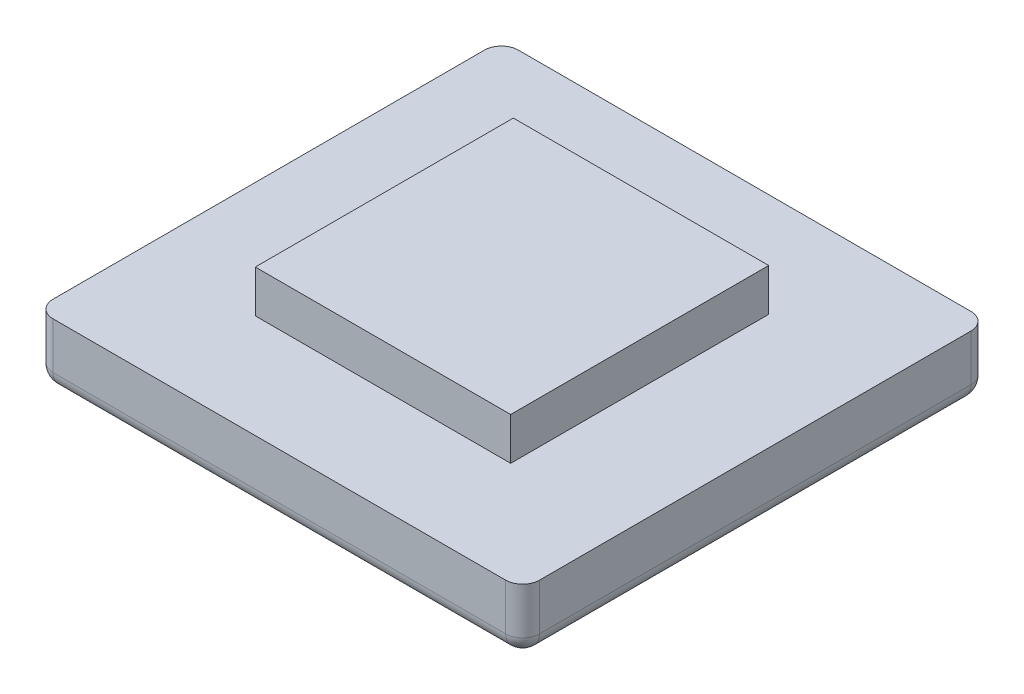
ISO-10303-21;
HEADER;
FILE_DESCRIPTION(('STEP AP214'),'2;1');
FILE_NAME('part.step','',(''),(''),'','','');
FILE_SCHEMA(('AUTOMOTIVE_DESIGN { 1 0 10303 214 1 1 1 1 }'));
ENDSEC;
DATA;
#1=APPLICATION_CONTEXT('core data for automotive mechanical design processes');
#2=APPLICATION_PROTOCOL_DEFINITION('international standard','automotive_design',2000,#1);
#3=PRODUCT_CONTEXT('',#1,'mechanical');
#4=PRODUCT('Part','Part','',(#3));
#5=PRODUCT_RELATED_PRODUCT_CATEGORY('part','',(#4));
#6=PRODUCT_DEFINITION_FORMATION('','',#4);
#7=PRODUCT_DEFINITION_CONTEXT('part definition',#1,'design');
#8=PRODUCT_DEFINITION('design','',#6,#7);
#9=PRODUCT_DEFINITION_SHAPE('','',#8);
#10=(LENGTH_UNIT() NAMED_UNIT(*) SI_UNIT(.MILLI.,.METRE.));
#11=(NAMED_UNIT(*) PLANE_ANGLE_UNIT() SI_UNIT($,.RADIAN.));
#12=(NAMED_UNIT(*) SI_UNIT($,.STERADIAN.) SOLID_ANGLE_UNIT());
#13=UNCERTAINTY_MEASURE_WITH_UNIT(LENGTH_MEASURE(1.E-05),#10,'distance_accuracy_value','');
#14=(GEOMETRIC_REPRESENTATION_CONTEXT(3) GLOBAL_UNCERTAINTY_ASSIGNED_CONTEXT((#13)) GLOBAL_UNIT_ASSIGNED_CONTEXT((#10,
#11,#12)) REPRESENTATION_CONTEXT('',''));
#15=CARTESIAN_POINT('',(0.,0.,0.));
#16=DIRECTION('',(0.,0.,1.));
#17=DIRECTION('',(1.,0.,0.));
#18=AXIS2_PLACEMENT_3D('',#15,#16,#17);
#19=CARTESIAN_POINT('',(0.,15.,0.));
#20=DIRECTION('',(0.,-1.,0.));
#21=DIRECTION('',(0.,0.,-1.));
#22=AXIS2_PLACEMENT_3D('',#19,#20,#21);
#23=PLANE('',#22);
#24=DIRECTION('',(0.,0.,-1.));
#25=VECTOR('',#24,1.);
#26=CARTESIAN_POINT('',(93.8648648648648,15.,53.8986486486486));
#27=LINE('',#26,#25);
#28=CARTESIAN_POINT('',(93.8648648648648,15.,49.8986486486486));
#29=VERTEX_POINT('',#28);
#30=CARTESIAN_POINT('',(93.8648648648649,15.,-52.1013513513514));
#31=VERTEX_POINT('',#30);
#32=EDGE_CURVE('E189',#29,#31,#27,.T.);
#33=ORIENTED_EDGE('',*,*,#32,.T.);
#34=CARTESIAN_POINT('',(89.8648648648649,15.,-52.1013513513514));
#35=DIRECTION('',(0.,-1.,0.));
#36=DIRECTION('',(0.,0.,-1.));
#37=AXIS2_PLACEMENT_3D('',#34,#35,#36);
#38=CIRCLE('',#37,4.);
#39=CARTESIAN_POINT('',(89.8648648648649,15.,-56.1013513513514));
#40=VERTEX_POINT('',#39);
#41=EDGE_CURVE('E11',#31,#40,#38,.F.);
#42=ORIENTED_EDGE('',*,*,#41,.T.);
#43=DIRECTION('',(-1.,0.,0.));
#44=VECTOR('',#43,1.);
#45=CARTESIAN_POINT('',(-21.1351351351351,15.,-56.1013513513514));
#46=LINE('',#45,#44);
#47=CARTESIAN_POINT('',(-17.1351351351351,15.,-56.1013513513514));
#48=VERTEX_POINT('',#47);
#49=EDGE_CURVE('E193',#40,#48,#46,.T.);
#50=ORIENTED_EDGE('',*,*,#49,.T.);
#51=CARTESIAN_POINT('',(-17.1351351351351,15.,-52.1013513513514));
#52=DIRECTION('',(0.,-1.,0.));
#53=DIRECTION('',(0.,0.,-1.));
#54=AXIS2_PLACEMENT_3D('',#51,#52,#53);
#55=CIRCLE('',#54,4.);
#56=CARTESIAN_POINT('',(-21.1351351351351,15.,-52.1013513513514));
#57=VERTEX_POINT('',#56);
#58=EDGE_CURVE('E245',#48,#57,#55,.F.);
#59=ORIENTED_EDGE('',*,*,#58,.T.);
#60=DIRECTION('',(0.,0.,1.));
#61=VECTOR('',#60,1.);
#62=CARTESIAN_POINT('',(-21.1351351351351,15.,53.8986486486486));
#63=LINE('',#62,#61);
#64=CARTESIAN_POINT('',(-21.1351351351351,15.,49.8986486486486));
#65=VERTEX_POINT('',#64);
#66=EDGE_CURVE('E175',#57,#65,#63,.T.);
#67=ORIENTED_EDGE('',*,*,#66,.T.);
#68=CARTESIAN_POINT('',(-17.1351351351351,15.,49.8986486486486));
#69=DIRECTION('',(0.,-1.,0.));
#70=DIRECTION('',(0.,0.,-1.));
#71=AXIS2_PLACEMENT_3D('',#68,#69,#70);
#72=CIRCLE('',#71,4.);
#73=CARTESIAN_POINT('',(-17.1351351351351,15.,53.8986486486486));
#74=VERTEX_POINT('',#73);
#75=EDGE_CURVE('E248',#65,#74,#72,.F.);
#76=ORIENTED_EDGE('',*,*,#75,.T.);
#77=DIRECTION('',(1.,0.,0.));
#78=VECTOR('',#77,1.);
#79=CARTESIAN_POINT('',(-21.1351351351351,15.,53.8986486486486));
#80=LINE('',#79,#78);
#81=CARTESIAN_POINT('',(89.8648648648648,15.,53.8986486486486));
#82=VERTEX_POINT('',#81);
#83=EDGE_CURVE('E180',#74,#82,#80,.T.);
#84=ORIENTED_EDGE('',*,*,#83,.T.);
#85=CARTESIAN_POINT('',(89.8648648648648,15.,49.8986486486486));
#86=DIRECTION('',(0.,-1.,0.));
#87=DIRECTION('',(0.,0.,-1.));
#88=AXIS2_PLACEMENT_3D('',#85,#86,#87);
#89=CIRCLE('',#88,4.);
#90=EDGE_CURVE('E54',#82,#29,#89,.F.);
#91=ORIENTED_EDGE('',*,*,#90,.T.);
#92=EDGE_LOOP('',(#33,#42,#50,#59,#67,#76,#84,#91));
#93=FACE_BOUND('',#92,.T.);
#94=DIRECTION('',(0.,0.,-1.));
#95=VECTOR('',#94,1.);
#96=CARTESIAN_POINT('',(66.5476731106836,15.,29.3926198660737));
#97=LINE('',#96,#95);
#98=CARTESIAN_POINT('',(66.5476731106836,15.,29.3926198660737));
#99=VERTEX_POINT('',#98);
#100=CARTESIAN_POINT('',(66.5476731106836,15.,-31.5953225687765));
#101=VERTEX_POINT('',#100);
#102=EDGE_CURVE('E173',#99,#101,#97,.T.);
#103=ORIENTED_EDGE('',*,*,#102,.F.);
#104=DIRECTION('',(1.,0.,0.));
#105=VECTOR('',#104,1.);
#106=CARTESIAN_POINT('',(6.18205661904607,15.,29.3926198660737));
#107=LINE('',#106,#105);
#108=CARTESIAN_POINT('',(6.18205661904607,15.,29.3926198660737));
#109=VERTEX_POINT('',#108);
#110=EDGE_CURVE('E170',#109,#99,#107,.T.);
#111=ORIENTED_EDGE('',*,*,#110,.F.);
#112=DIRECTION('',(0.,0.,1.));
#113=VECTOR('',#112,1.);
#114=CARTESIAN_POINT('',(6.18205661904607,15.,29.3926198660737));
#115=LINE('',#114,#113);
#116=CARTESIAN_POINT('',(6.18205661904607,15.,-31.5953225687765));
#117=VERTEX_POINT('',#116);
#118=EDGE_CURVE('E302',#117,#109,#115,.T.);
#119=ORIENTED_EDGE('',*,*,#118,.F.);
#120=DIRECTION('',(-1.,0.,0.));
#121=VECTOR('',#120,1.);
#122=CARTESIAN_POINT('',(6.18205661904607,15.,-31.5953225687765));
#123=LINE('',#122,#121);
#124=EDGE_CURVE('E299',#101,#117,#123,.T.);
#125=ORIENTED_EDGE('',*,*,#124,.F.);
#126=EDGE_LOOP('',(#103,#111,#119,#125));
#127=FACE_BOUND('',#126,.T.);
#128=ADVANCED_FACE('F44',(#93,#127),#23,.F.);
#129=CARTESIAN_POINT('',(-21.1351351351351,15.,53.8986486486486));
#130=DIRECTION('',(1.,0.,0.));
#131=DIRECTION('',(0.,0.,-1.));
#132=AXIS2_PLACEMENT_3D('',#129,#130,#131);
#133=PLANE('',#132);
#134=DIRECTION('',(0.,0.,1.));
#135=VECTOR('',#134,1.);
#136=CARTESIAN_POINT('',(-21.1351351351351,4.,53.8986486486486));
#137=LINE('',#136,#135);
#138=CARTESIAN_POINT('',(-21.1351351351351,4.,-52.1013513513514));
#139=VERTEX_POINT('',#138);
#140=CARTESIAN_POINT('',(-21.1351351351351,4.,49.8986486486486));
#141=VERTEX_POINT('',#140);
#142=EDGE_CURVE('E62',#139,#141,#137,.T.);
#143=ORIENTED_EDGE('',*,*,#142,.T.);
#144=DIRECTION('',(0.,-1.,0.));
#145=VECTOR('',#144,1.);
#146=CARTESIAN_POINT('',(-21.1351351351351,15.,49.8986486486486));
#147=LINE('',#146,#145);
#148=EDGE_CURVE('E242',#141,#65,#147,.F.);
#149=ORIENTED_EDGE('',*,*,#148,.T.);
#150=ORIENTED_EDGE('',*,*,#66,.F.);
#151=DIRECTION('',(0.,-1.,0.));
#152=VECTOR('',#151,1.);
#153=CARTESIAN_POINT('',(-21.1351351351351,15.,-52.1013513513514));
#154=LINE('',#153,#152);
#155=EDGE_CURVE('E67',#57,#139,#154,.T.);
#156=ORIENTED_EDGE('',*,*,#155,.T.);
#157=EDGE_LOOP('',(#143,#149,#150,#156));
#158=FACE_BOUND('',#157,.T.);
#159=ADVANCED_FACE('F324',(#158),#133,.F.);
#160=CARTESIAN_POINT('',(-21.1351351351351,15.,53.8986486486486));
#161=DIRECTION('',(0.,0.,-1.));
#162=DIRECTION('',(-1.,0.,0.));
#163=AXIS2_PLACEMENT_3D('',#160,#161,#162);
#164=PLANE('',#163);
#165=DIRECTION('',(1.,0.,0.));
#166=VECTOR('',#165,1.);
#167=CARTESIAN_POINT('',(93.8648648648648,4.,53.8986486486486));
#168=LINE('',#167,#166);
#169=CARTESIAN_POINT('',(-17.1351351351351,4.,53.8986486486486));
#170=VERTEX_POINT('',#169);
#171=CARTESIAN_POINT('',(89.8648648648648,4.,53.8986486486486));
#172=VERTEX_POINT('',#171);
#173=EDGE_CURVE('E200',#170,#172,#168,.T.);
#174=ORIENTED_EDGE('',*,*,#173,.T.);
#175=DIRECTION('',(0.,-1.,0.));
#176=VECTOR('',#175,1.);
#177=CARTESIAN_POINT('',(89.8648648648648,15.,53.8986486486486));
#178=LINE('',#177,#176);
#179=EDGE_CURVE('E204',#172,#82,#178,.F.);
#180=ORIENTED_EDGE('',*,*,#179,.T.);
#181=ORIENTED_EDGE('',*,*,#83,.F.);
#182=DIRECTION('',(0.,-1.,0.));
#183=VECTOR('',#182,1.);
#184=CARTESIAN_POINT('',(-17.1351351351351,15.,53.8986486486486));
#185=LINE('',#184,#183);
#186=EDGE_CURVE('E197',#74,#170,#185,.T.);
#187=ORIENTED_EDGE('',*,*,#186,.T.);
#188=EDGE_LOOP('',(#174,#180,#181,#187));
#189=FACE_BOUND('',#188,.T.);
#190=ADVANCED_FACE('F330',(#189),#164,.F.);
#191=CARTESIAN_POINT('',(93.8648648648648,15.,53.8986486486486));
#192=DIRECTION('',(-1.,0.,0.));
#193=DIRECTION('',(0.,0.,1.));
#194=AXIS2_PLACEMENT_3D('',#191,#192,#193);
#195=PLANE('',#194);
#196=DIRECTION('',(0.,0.,-1.));
#197=VECTOR('',#196,1.);
#198=CARTESIAN_POINT('',(93.8648648648649,4.,-56.1013513513514));
#199=LINE('',#198,#197);
#200=CARTESIAN_POINT('',(93.8648648648648,4.,49.8986486486486));
#201=VERTEX_POINT('',#200);
#202=CARTESIAN_POINT('',(93.8648648648649,4.,-52.1013513513514));
#203=VERTEX_POINT('',#202);
#204=EDGE_CURVE('E223',#201,#203,#199,.T.);
#205=ORIENTED_EDGE('',*,*,#204,.T.);
#206=DIRECTION('',(0.,-1.,0.));
#207=VECTOR('',#206,1.);
#208=CARTESIAN_POINT('',(93.8648648648649,15.,-52.1013513513514));
#209=LINE('',#208,#207);
#210=EDGE_CURVE('E226',#203,#31,#209,.F.);
#211=ORIENTED_EDGE('',*,*,#210,.T.);
#212=ORIENTED_EDGE('',*,*,#32,.F.);
#213=DIRECTION('',(0.,-1.,0.));
#214=VECTOR('',#213,1.);
#215=CARTESIAN_POINT('',(93.8648648648648,15.,49.8986486486486));
#216=LINE('',#215,#214);
#217=EDGE_CURVE('E220',#29,#201,#216,.T.);
#218=ORIENTED_EDGE('',*,*,#217,.T.);
#219=EDGE_LOOP('',(#205,#211,#212,#218));
#220=FACE_BOUND('',#219,.T.);
#221=ADVANCED_FACE('F342',(#220),#195,.F.);
#222=CARTESIAN_POINT('',(-21.1351351351351,15.,-56.1013513513514));
#223=DIRECTION('',(0.,0.,1.));
#224=DIRECTION('',(1.,0.,0.));
#225=AXIS2_PLACEMENT_3D('',#222,#223,#224);
#226=PLANE('',#225);
#227=ORIENTED_EDGE('',*,*,#49,.F.);
#228=DIRECTION('',(0.,-1.,0.));
#229=VECTOR('',#228,1.);
#230=CARTESIAN_POINT('',(89.8648648648649,15.,-56.1013513513514));
#231=LINE('',#230,#229);
#232=CARTESIAN_POINT('',(89.8648648648649,4.,-56.1013513513514));
#233=VERTEX_POINT('',#232);
#234=EDGE_CURVE('E235',#40,#233,#231,.T.);
#235=ORIENTED_EDGE('',*,*,#234,.T.);
#236=DIRECTION('',(-1.,0.,0.));
#237=VECTOR('',#236,1.);
#238=CARTESIAN_POINT('',(-21.1351351351351,4.,-56.1013513513514));
#239=LINE('',#238,#237);
#240=CARTESIAN_POINT('',(-17.1351351351351,4.,-56.1013513513514));
#241=VERTEX_POINT('',#240);
#242=EDGE_CURVE('E232',#233,#241,#239,.T.);
#243=ORIENTED_EDGE('',*,*,#242,.T.);
#244=DIRECTION('',(0.,-1.,0.));
#245=VECTOR('',#244,1.);
#246=CARTESIAN_POINT('',(-17.1351351351351,15.,-56.1013513513514));
#247=LINE('',#246,#245);
#248=EDGE_CURVE('E229',#241,#48,#247,.F.);
#249=ORIENTED_EDGE('',*,*,#248,.T.);
#250=EDGE_LOOP('',(#227,#235,#243,#249));
#251=FACE_BOUND('',#250,.T.);
#252=ADVANCED_FACE('F338',(#251),#226,.F.);
#253=CARTESIAN_POINT('',(0.,0.,0.));
#254=DIRECTION('',(0.,-1.,0.));
#255=DIRECTION('',(0.,0.,-1.));
#256=AXIS2_PLACEMENT_3D('',#253,#254,#255);
#257=PLANE('',#256);
#258=DIRECTION('',(0.,0.,-1.));
#259=VECTOR('',#258,1.);
#260=CARTESIAN_POINT('',(89.8648648648648,0.,53.8986486486486));
#261=LINE('',#260,#259);
#262=CARTESIAN_POINT('',(89.8648648648649,0.,-52.1013513513514));
#263=VERTEX_POINT('',#262);
#264=CARTESIAN_POINT('',(89.8648648648648,0.,49.8986486486486));
#265=VERTEX_POINT('',#264);
#266=EDGE_CURVE('E213',#263,#265,#261,.F.);
#267=ORIENTED_EDGE('',*,*,#266,.T.);
#268=DIRECTION('',(1.,0.,0.));
#269=VECTOR('',#268,1.);
#270=CARTESIAN_POINT('',(-21.1351351351351,0.,49.8986486486486));
#271=LINE('',#270,#269);
#272=CARTESIAN_POINT('',(-17.1351351351351,0.,49.8986486486486));
#273=VERTEX_POINT('',#272);
#274=EDGE_CURVE('E216',#265,#273,#271,.F.);
#275=ORIENTED_EDGE('',*,*,#274,.T.);
#276=DIRECTION('',(0.,0.,1.));
#277=VECTOR('',#276,1.);
#278=CARTESIAN_POINT('',(-17.1351351351351,0.,-56.1013513513514));
#279=LINE('',#278,#277);
#280=CARTESIAN_POINT('',(-17.1351351351351,0.,-52.1013513513514));
#281=VERTEX_POINT('',#280);
#282=EDGE_CURVE('E207',#273,#281,#279,.F.);
#283=ORIENTED_EDGE('',*,*,#282,.T.);
#284=DIRECTION('',(-1.,0.,0.));
#285=VECTOR('',#284,1.);
#286=CARTESIAN_POINT('',(93.8648648648649,0.,-52.1013513513514));
#287=LINE('',#286,#285);
#288=EDGE_CURVE('E210',#281,#263,#287,.F.);
#289=ORIENTED_EDGE('',*,*,#288,.T.);
#290=EDGE_LOOP('',(#267,#275,#283,#289));
#291=FACE_BOUND('',#290,.T.);
#292=ADVANCED_FACE('F335',(#291),#257,.T.);
#293=CARTESIAN_POINT('',(66.5476731106836,25.,29.3926198660737));
#294=DIRECTION('',(-1.,0.,0.));
#295=DIRECTION('',(0.,0.,1.));
#296=AXIS2_PLACEMENT_3D('',#293,#294,#295);
#297=PLANE('',#296);
#298=ORIENTED_EDGE('',*,*,#102,.T.);
#299=DIRECTION('',(0.,-1.,0.));
#300=VECTOR('',#299,1.);
#301=CARTESIAN_POINT('',(66.5476731106836,25.,-31.5953225687765));
#302=LINE('',#301,#300);
#303=CARTESIAN_POINT('',(66.5476731106836,25.,-31.5953225687765));
#304=VERTEX_POINT('',#303);
#305=EDGE_CURVE('E152',#304,#101,#302,.T.);
#306=ORIENTED_EDGE('',*,*,#305,.F.);
#307=DIRECTION('',(0.,0.,-1.));
#308=VECTOR('',#307,1.);
#309=CARTESIAN_POINT('',(66.5476731106836,25.,29.3926198660737));
#310=LINE('',#309,#308);
#311=CARTESIAN_POINT('',(66.5476731106836,25.,29.3926198660737));
#312=VERTEX_POINT('',#311);
#313=EDGE_CURVE('E160',#312,#304,#310,.T.);
#314=ORIENTED_EDGE('',*,*,#313,.F.);
#315=DIRECTION('',(0.,-1.,0.));
#316=VECTOR('',#315,1.);
#317=CARTESIAN_POINT('',(66.5476731106836,25.,29.3926198660737));
#318=LINE('',#317,#316);
#319=EDGE_CURVE('E313',#312,#99,#318,.T.);
#320=ORIENTED_EDGE('',*,*,#319,.T.);
#321=EDGE_LOOP('',(#298,#306,#314,#320));
#322=FACE_BOUND('',#321,.T.);
#323=ADVANCED_FACE('F172',(#322),#297,.F.);
#324=CARTESIAN_POINT('',(6.18205661904607,25.,-31.5953225687765));
#325=DIRECTION('',(0.,0.,1.));
#326=DIRECTION('',(1.,0.,0.));
#327=AXIS2_PLACEMENT_3D('',#324,#325,#326);
#328=PLANE('',#327);
#329=ORIENTED_EDGE('',*,*,#124,.T.);
#330=DIRECTION('',(0.,-1.,0.));
#331=VECTOR('',#330,1.);
#332=CARTESIAN_POINT('',(6.18205661904607,25.,-31.5953225687765));
#333=LINE('',#332,#331);
#334=CARTESIAN_POINT('',(6.18205661904607,25.,-31.5953225687765));
#335=VERTEX_POINT('',#334);
#336=EDGE_CURVE('E155',#335,#117,#333,.T.);
#337=ORIENTED_EDGE('',*,*,#336,.F.);
#338=DIRECTION('',(-1.,0.,0.));
#339=VECTOR('',#338,1.);
#340=CARTESIAN_POINT('',(6.18205661904607,25.,-31.5953225687765));
#341=LINE('',#340,#339);
#342=EDGE_CURVE('E147',#304,#335,#341,.T.);
#343=ORIENTED_EDGE('',*,*,#342,.F.);
#344=ORIENTED_EDGE('',*,*,#305,.T.);
#345=EDGE_LOOP('',(#329,#337,#343,#344));
#346=FACE_BOUND('',#345,.T.);
#347=ADVANCED_FACE('F150',(#346),#328,.F.);
#348=CARTESIAN_POINT('',(6.18205661904607,25.,29.3926198660737));
#349=DIRECTION('',(1.,0.,0.));
#350=DIRECTION('',(0.,0.,-1.));
#351=AXIS2_PLACEMENT_3D('',#348,#349,#350);
#352=PLANE('',#351);
#353=ORIENTED_EDGE('',*,*,#118,.T.);
#354=DIRECTION('',(0.,-1.,0.));
#355=VECTOR('',#354,1.);
#356=CARTESIAN_POINT('',(6.18205661904607,25.,29.3926198660737));
#357=LINE('',#356,#355);
#358=CARTESIAN_POINT('',(6.18205661904607,25.,29.3926198660737));
#359=VERTEX_POINT('',#358);
#360=EDGE_CURVE('E182',#359,#109,#357,.T.);
#361=ORIENTED_EDGE('',*,*,#360,.F.);
#362=DIRECTION('',(0.,0.,1.));
#363=VECTOR('',#362,1.);
#364=CARTESIAN_POINT('',(6.18205661904607,25.,29.3926198660737));
#365=LINE('',#364,#363);
#366=EDGE_CURVE('E159',#335,#359,#365,.T.);
#367=ORIENTED_EDGE('',*,*,#366,.F.);
#368=ORIENTED_EDGE('',*,*,#336,.T.);
#369=EDGE_LOOP('',(#353,#361,#367,#368));
#370=FACE_BOUND('',#369,.T.);
#371=ADVANCED_FACE('F321',(#370),#352,.F.);
#372=CARTESIAN_POINT('',(6.18205661904607,25.,29.3926198660737));
#373=DIRECTION('',(0.,0.,-1.));
#374=DIRECTION('',(-1.,0.,0.));
#375=AXIS2_PLACEMENT_3D('',#372,#373,#374);
#376=PLANE('',#375);
#377=ORIENTED_EDGE('',*,*,#110,.T.);
#378=ORIENTED_EDGE('',*,*,#319,.F.);
#379=DIRECTION('',(1.,0.,0.));
#380=VECTOR('',#379,1.);
#381=CARTESIAN_POINT('',(6.18205661904607,25.,29.3926198660737));
#382=LINE('',#381,#380);
#383=EDGE_CURVE('E165',#359,#312,#382,.T.);
#384=ORIENTED_EDGE('',*,*,#383,.F.);
#385=ORIENTED_EDGE('',*,*,#360,.T.);
#386=EDGE_LOOP('',(#377,#378,#384,#385));
#387=FACE_BOUND('',#386,.T.);
#388=ADVANCED_FACE('F319',(#387),#376,.F.);
#389=CARTESIAN_POINT('',(0.,25.,0.));
#390=DIRECTION('',(0.,-1.,0.));
#391=DIRECTION('',(0.,0.,-1.));
#392=AXIS2_PLACEMENT_3D('',#389,#390,#391);
#393=PLANE('',#392);
#394=ORIENTED_EDGE('',*,*,#313,.T.);
#395=ORIENTED_EDGE('',*,*,#342,.T.);
#396=ORIENTED_EDGE('',*,*,#366,.T.);
#397=ORIENTED_EDGE('',*,*,#383,.T.);
#398=EDGE_LOOP('',(#394,#395,#396,#397));
#399=FACE_BOUND('',#398,.T.);
#400=ADVANCED_FACE('F163',(#399),#393,.F.);
#401=CARTESIAN_POINT('',(-17.1351351351351,15.,-52.1013513513514));
#402=DIRECTION('',(0.,-1.,0.));
#403=DIRECTION('',(0.,0.,-1.));
#404=AXIS2_PLACEMENT_3D('',#401,#402,#403);
#405=CYLINDRICAL_SURFACE('',#404,4.);
#406=ORIENTED_EDGE('',*,*,#58,.F.);
#407=ORIENTED_EDGE('',*,*,#248,.F.);
#408=CARTESIAN_POINT('',(-17.1351351351351,4.,-52.1013513513514));
#409=DIRECTION('',(0.,-1.,0.));
#410=DIRECTION('',(0.,0.,-1.));
#411=AXIS2_PLACEMENT_3D('',#408,#409,#410);
#412=CIRCLE('',#411,4.);
#413=EDGE_CURVE('E290',#139,#241,#412,.T.);
#414=ORIENTED_EDGE('',*,*,#413,.F.);
#415=ORIENTED_EDGE('',*,*,#155,.F.);
#416=EDGE_LOOP('',(#406,#407,#414,#415));
#417=FACE_BOUND('',#416,.T.);
#418=ADVANCED_FACE('F46',(#417),#405,.T.);
#419=CARTESIAN_POINT('',(89.8648648648649,15.,-52.1013513513514));
#420=DIRECTION('',(0.,-1.,0.));
#421=DIRECTION('',(0.,0.,-1.));
#422=AXIS2_PLACEMENT_3D('',#419,#420,#421);
#423=CYLINDRICAL_SURFACE('',#422,4.);
#424=ORIENTED_EDGE('',*,*,#41,.F.);
#425=ORIENTED_EDGE('',*,*,#210,.F.);
#426=CARTESIAN_POINT('',(89.8648648648649,4.,-52.1013513513514));
#427=DIRECTION('',(0.,-1.,0.));
#428=DIRECTION('',(0.,0.,-1.));
#429=AXIS2_PLACEMENT_3D('',#426,#427,#428);
#430=CIRCLE('',#429,4.);
#431=EDGE_CURVE('E287',#233,#203,#430,.T.);
#432=ORIENTED_EDGE('',*,*,#431,.F.);
#433=ORIENTED_EDGE('',*,*,#234,.F.);
#434=EDGE_LOOP('',(#424,#425,#432,#433));
#435=FACE_BOUND('',#434,.T.);
#436=ADVANCED_FACE('F387',(#435),#423,.T.);
#437=CARTESIAN_POINT('',(-21.1351351351351,4.,-52.1013513513514));
#438=DIRECTION('',(1.,0.,0.));
#439=DIRECTION('',(0.,0.,-1.));
#440=AXIS2_PLACEMENT_3D('',#437,#438,#439);
#441=CYLINDRICAL_SURFACE('',#440,4.);
#442=CARTESIAN_POINT('',(-17.1351351351351,4.,-52.1013513513514));
#443=DIRECTION('',(-1.,0.,0.));
#444=DIRECTION('',(0.,0.,1.));
#445=AXIS2_PLACEMENT_3D('',#442,#443,#444);
#446=CIRCLE('',#445,4.);
#447=EDGE_CURVE('E48',#241,#281,#446,.T.);
#448=ORIENTED_EDGE('',*,*,#447,.F.);
#449=ORIENTED_EDGE('',*,*,#242,.F.);
#450=CARTESIAN_POINT('',(89.8648648648649,4.,-52.1013513513514));
#451=DIRECTION('',(1.,0.,0.));
#452=DIRECTION('',(0.,0.,-1.));
#453=AXIS2_PLACEMENT_3D('',#450,#451,#452);
#454=CIRCLE('',#453,4.);
#455=EDGE_CURVE('E283',#263,#233,#454,.T.);
#456=ORIENTED_EDGE('',*,*,#455,.F.);
#457=ORIENTED_EDGE('',*,*,#288,.F.);
#458=EDGE_LOOP('',(#448,#449,#456,#457));
#459=FACE_BOUND('',#458,.T.);
#460=ADVANCED_FACE('F385',(#459),#441,.T.);
#461=CARTESIAN_POINT('',(-17.1351351351351,4.,-52.1013513513514));
#462=DIRECTION('',(0.,0.,-1.));
#463=DIRECTION('',(-1.,0.,0.));
#464=AXIS2_PLACEMENT_3D('',#461,#462,#463);
#465=SPHERICAL_SURFACE('',#464,4.);
#466=ORIENTED_EDGE('',*,*,#413,.T.);
#467=ORIENTED_EDGE('',*,*,#447,.T.);
#468=CARTESIAN_POINT('',(-17.1351351351351,4.,-52.1013513513514));
#469=DIRECTION('',(0.,0.,-1.));
#470=DIRECTION('',(-1.,0.,0.));
#471=AXIS2_PLACEMENT_3D('',#468,#469,#470);
#472=CIRCLE('',#471,4.);
#473=EDGE_CURVE('E279',#139,#281,#472,.F.);
#474=ORIENTED_EDGE('',*,*,#473,.F.);
#475=EDGE_LOOP('',(#466,#467,#474));
#476=FACE_BOUND('',#475,.T.);
#477=ADVANCED_FACE('F381',(#476),#465,.T.);
#478=CARTESIAN_POINT('',(89.8648648648649,4.,-52.1013513513514));
#479=DIRECTION('',(0.,0.,-1.));
#480=DIRECTION('',(-1.,0.,0.));
#481=AXIS2_PLACEMENT_3D('',#478,#479,#480);
#482=SPHERICAL_SURFACE('',#481,4.);
#483=ORIENTED_EDGE('',*,*,#455,.T.);
#484=ORIENTED_EDGE('',*,*,#431,.T.);
#485=CARTESIAN_POINT('',(89.8648648648649,4.,-52.1013513513514));
#486=DIRECTION('',(0.,0.,-1.));
#487=DIRECTION('',(-1.,0.,0.));
#488=AXIS2_PLACEMENT_3D('',#485,#486,#487);
#489=CIRCLE('',#488,4.);
#490=EDGE_CURVE('E275',#263,#203,#489,.F.);
#491=ORIENTED_EDGE('',*,*,#490,.F.);
#492=EDGE_LOOP('',(#483,#484,#491));
#493=FACE_BOUND('',#492,.T.);
#494=ADVANCED_FACE('F377',(#493),#482,.T.);
#495=CARTESIAN_POINT('',(-17.1351351351351,4.,53.8986486486486));
#496=DIRECTION('',(0.,0.,-1.));
#497=DIRECTION('',(-1.,0.,0.));
#498=AXIS2_PLACEMENT_3D('',#495,#496,#497);
#499=CYLINDRICAL_SURFACE('',#498,4.);
#500=ORIENTED_EDGE('',*,*,#473,.T.);
#501=ORIENTED_EDGE('',*,*,#282,.F.);
#502=CARTESIAN_POINT('',(-17.1351351351351,4.,49.8986486486486));
#503=DIRECTION('',(0.,0.,1.));
#504=DIRECTION('',(1.,0.,0.));
#505=AXIS2_PLACEMENT_3D('',#502,#503,#504);
#506=CIRCLE('',#505,4.);
#507=EDGE_CURVE('E271',#141,#273,#506,.T.);
#508=ORIENTED_EDGE('',*,*,#507,.F.);
#509=ORIENTED_EDGE('',*,*,#142,.F.);
#510=EDGE_LOOP('',(#500,#501,#508,#509));
#511=FACE_BOUND('',#510,.T.);
#512=ADVANCED_FACE('F373',(#511),#499,.T.);
#513=CARTESIAN_POINT('',(-17.1351351351351,15.,49.8986486486486));
#514=DIRECTION('',(0.,-1.,0.));
#515=DIRECTION('',(0.,0.,-1.));
#516=AXIS2_PLACEMENT_3D('',#513,#514,#515);
#517=CYLINDRICAL_SURFACE('',#516,4.);
#518=ORIENTED_EDGE('',*,*,#75,.F.);
#519=ORIENTED_EDGE('',*,*,#148,.F.);
#520=CARTESIAN_POINT('',(-17.1351351351351,4.,49.8986486486486));
#521=DIRECTION('',(0.,-1.,0.));
#522=DIRECTION('',(0.,0.,-1.));
#523=AXIS2_PLACEMENT_3D('',#520,#521,#522);
#524=CIRCLE('',#523,4.);
#525=EDGE_CURVE('E267',#170,#141,#524,.T.);
#526=ORIENTED_EDGE('',*,*,#525,.F.);
#527=ORIENTED_EDGE('',*,*,#186,.F.);
#528=EDGE_LOOP('',(#518,#519,#526,#527));
#529=FACE_BOUND('',#528,.T.);
#530=ADVANCED_FACE('F369',(#529),#517,.T.);
#531=CARTESIAN_POINT('',(89.8648648648648,15.,49.8986486486486));
#532=DIRECTION('',(0.,-1.,0.));
#533=DIRECTION('',(0.,0.,-1.));
#534=AXIS2_PLACEMENT_3D('',#531,#532,#533);
#535=CYLINDRICAL_SURFACE('',#534,4.);
#536=ORIENTED_EDGE('',*,*,#90,.F.);
#537=ORIENTED_EDGE('',*,*,#179,.F.);
#538=CARTESIAN_POINT('',(89.8648648648648,4.,49.8986486486486));
#539=DIRECTION('',(0.,-1.,0.));
#540=DIRECTION('',(0.,0.,-1.));
#541=AXIS2_PLACEMENT_3D('',#538,#539,#540);
#542=CIRCLE('',#541,4.);
#543=EDGE_CURVE('E263',#201,#172,#542,.T.);
#544=ORIENTED_EDGE('',*,*,#543,.F.);
#545=ORIENTED_EDGE('',*,*,#217,.F.);
#546=EDGE_LOOP('',(#536,#537,#544,#545));
#547=FACE_BOUND('',#546,.T.);
#548=ADVANCED_FACE('F365',(#547),#535,.T.);
#549=CARTESIAN_POINT('',(89.8648648648648,4.,53.8986486486486));
#550=DIRECTION('',(0.,0.,1.));
#551=DIRECTION('',(1.,0.,0.));
#552=AXIS2_PLACEMENT_3D('',#549,#550,#551);
#553=CYLINDRICAL_SURFACE('',#552,4.);
#554=ORIENTED_EDGE('',*,*,#490,.T.);
#555=ORIENTED_EDGE('',*,*,#204,.F.);
#556=CARTESIAN_POINT('',(89.8648648648648,4.,49.8986486486486));
#557=DIRECTION('',(0.,0.,1.));
#558=DIRECTION('',(1.,0.,0.));
#559=AXIS2_PLACEMENT_3D('',#556,#557,#558);
#560=CIRCLE('',#559,4.);
#561=EDGE_CURVE('E259',#265,#201,#560,.T.);
#562=ORIENTED_EDGE('',*,*,#561,.F.);
#563=ORIENTED_EDGE('',*,*,#266,.F.);
#564=EDGE_LOOP('',(#554,#555,#562,#563));
#565=FACE_BOUND('',#564,.T.);
#566=ADVANCED_FACE('F361',(#565),#553,.T.);
#567=CARTESIAN_POINT('',(-17.1351351351351,4.,49.8986486486486));
#568=DIRECTION('',(-1.,0.,0.));
#569=DIRECTION('',(0.,0.,1.));
#570=AXIS2_PLACEMENT_3D('',#567,#568,#569);
#571=SPHERICAL_SURFACE('',#570,4.);
#572=ORIENTED_EDGE('',*,*,#525,.T.);
#573=ORIENTED_EDGE('',*,*,#507,.T.);
#574=CARTESIAN_POINT('',(-17.1351351351351,4.,49.8986486486486));
#575=DIRECTION('',(-1.,0.,0.));
#576=DIRECTION('',(0.,0.,1.));
#577=AXIS2_PLACEMENT_3D('',#574,#575,#576);
#578=CIRCLE('',#577,4.);
#579=EDGE_CURVE('E256',#170,#273,#578,.F.);
#580=ORIENTED_EDGE('',*,*,#579,.F.);
#581=EDGE_LOOP('',(#572,#573,#580));
#582=FACE_BOUND('',#581,.T.);
#583=ADVANCED_FACE('F357',(#582),#571,.T.);
#584=CARTESIAN_POINT('',(89.8648648648648,4.,49.8986486486486));
#585=DIRECTION('',(1.,0.,0.));
#586=DIRECTION('',(0.,0.,-1.));
#587=AXIS2_PLACEMENT_3D('',#584,#585,#586);
#588=SPHERICAL_SURFACE('',#587,4.);
#589=ORIENTED_EDGE('',*,*,#561,.T.);
#590=ORIENTED_EDGE('',*,*,#543,.T.);
#591=CARTESIAN_POINT('',(89.8648648648648,4.,49.8986486486486));
#592=DIRECTION('',(1.,0.,0.));
#593=DIRECTION('',(0.,0.,-1.));
#594=AXIS2_PLACEMENT_3D('',#591,#592,#593);
#595=CIRCLE('',#594,4.);
#596=EDGE_CURVE('E253',#265,#172,#595,.F.);
#597=ORIENTED_EDGE('',*,*,#596,.F.);
#598=EDGE_LOOP('',(#589,#590,#597));
#599=FACE_BOUND('',#598,.T.);
#600=ADVANCED_FACE('F353',(#599),#588,.T.);
#601=CARTESIAN_POINT('',(-21.1351351351351,4.,49.8986486486486));
#602=DIRECTION('',(-1.,0.,0.));
#603=DIRECTION('',(0.,0.,1.));
#604=AXIS2_PLACEMENT_3D('',#601,#602,#603);
#605=CYLINDRICAL_SURFACE('',#604,4.);
#606=ORIENTED_EDGE('',*,*,#579,.T.);
#607=ORIENTED_EDGE('',*,*,#274,.F.);
#608=ORIENTED_EDGE('',*,*,#596,.T.);
#609=ORIENTED_EDGE('',*,*,#173,.F.);
#610=EDGE_LOOP('',(#606,#607,#608,#609));
#611=FACE_BOUND('',#610,.T.);
#612=ADVANCED_FACE('F350',(#611),#605,.T.);
#613=CLOSED_SHELL('',(#128,#159,#190,#221,#252,#292,#323,#347,#371,#388,#400,#418,#436,#460,
#477,#494,#512,#530,#548,#566,#583,#600,#612));
#614=MANIFOLD_SOLID_BREP('B2',#613);
#615=ADVANCED_BREP_SHAPE_REPRESENTATION('',(#18,#614),#14);
#616=SHAPE_DEFINITION_REPRESENTATION(#9,#615);
ENDSEC;
END-ISO-10303-21;
